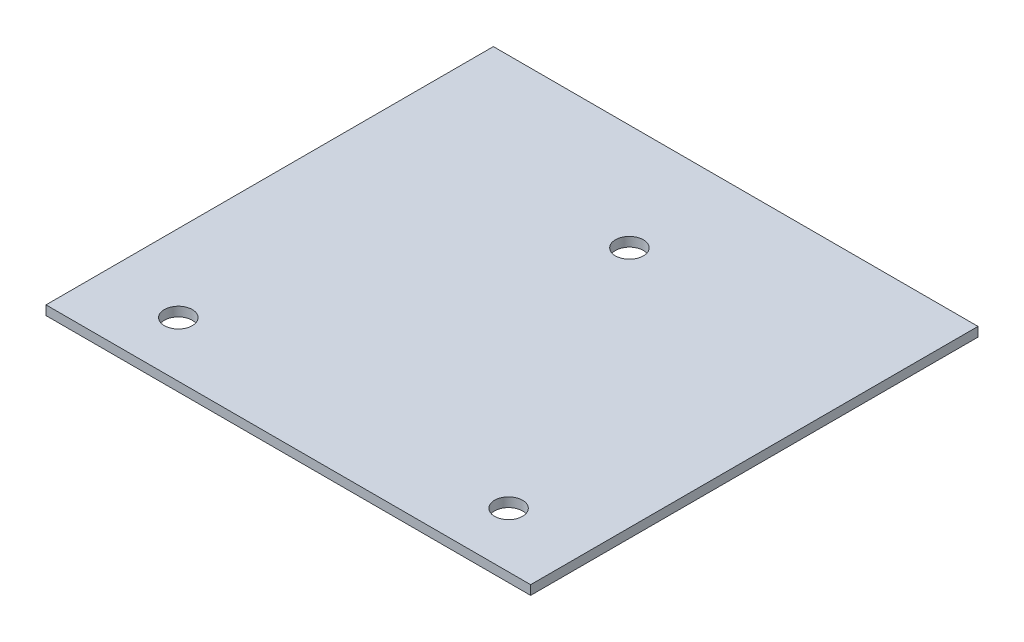
ISO-10303-21;
HEADER;
FILE_DESCRIPTION(('STEP AP214'),'2;1');
FILE_NAME('part.step','',(''),(''),'','','');
FILE_SCHEMA(('AUTOMOTIVE_DESIGN { 1 0 10303 214 1 1 1 1 }'));
ENDSEC;
DATA;
#1=APPLICATION_CONTEXT('core data for automotive mechanical design processes');
#2=APPLICATION_PROTOCOL_DEFINITION('international standard','automotive_design',2000,#1);
#3=PRODUCT_CONTEXT('',#1,'mechanical');
#4=PRODUCT('Part','Part','',(#3));
#5=PRODUCT_RELATED_PRODUCT_CATEGORY('part','',(#4));
#6=PRODUCT_DEFINITION_FORMATION('','',#4);
#7=PRODUCT_DEFINITION_CONTEXT('part definition',#1,'design');
#8=PRODUCT_DEFINITION('design','',#6,#7);
#9=PRODUCT_DEFINITION_SHAPE('','',#8);
#10=(LENGTH_UNIT() NAMED_UNIT(*) SI_UNIT(.MILLI.,.METRE.));
#11=(NAMED_UNIT(*) PLANE_ANGLE_UNIT() SI_UNIT($,.RADIAN.));
#12=(NAMED_UNIT(*) SI_UNIT($,.STERADIAN.) SOLID_ANGLE_UNIT());
#13=UNCERTAINTY_MEASURE_WITH_UNIT(LENGTH_MEASURE(1.E-05),#10,'distance_accuracy_value','');
#14=(GEOMETRIC_REPRESENTATION_CONTEXT(3) GLOBAL_UNCERTAINTY_ASSIGNED_CONTEXT((#13)) GLOBAL_UNIT_ASSIGNED_CONTEXT((#10,
#11,#12)) REPRESENTATION_CONTEXT('',''));
#15=CARTESIAN_POINT('',(0.,0.,0.));
#16=DIRECTION('',(0.,0.,1.));
#17=DIRECTION('',(1.,0.,0.));
#18=AXIS2_PLACEMENT_3D('',#15,#16,#17);
#19=CARTESIAN_POINT('',(0.,12.7,0.));
#20=DIRECTION('',(1.,0.,0.));
#21=DIRECTION('',(0.,0.,-1.));
#22=AXIS2_PLACEMENT_3D('',#19,#20,#21);
#23=PLANE('',#22);
#24=DIRECTION('',(0.,0.,1.));
#25=VECTOR('',#24,1.);
#26=CARTESIAN_POINT('',(0.,0.,0.));
#27=LINE('',#26,#25);
#28=CARTESIAN_POINT('',(0.,0.,-609.6));
#29=VERTEX_POINT('',#28);
#30=CARTESIAN_POINT('',(0.,0.,0.));
#31=VERTEX_POINT('',#30);
#32=EDGE_CURVE('E106',#29,#31,#27,.T.);
#33=ORIENTED_EDGE('',*,*,#32,.T.);
#34=DIRECTION('',(0.,-1.,0.));
#35=VECTOR('',#34,1.);
#36=CARTESIAN_POINT('',(0.,12.7,0.));
#37=LINE('',#36,#35);
#38=CARTESIAN_POINT('',(0.,12.7,0.));
#39=VERTEX_POINT('',#38);
#40=EDGE_CURVE('E11',#39,#31,#37,.T.);
#41=ORIENTED_EDGE('',*,*,#40,.F.);
#42=DIRECTION('',(0.,0.,1.));
#43=VECTOR('',#42,1.);
#44=CARTESIAN_POINT('',(0.,12.7,0.));
#45=LINE('',#44,#43);
#46=CARTESIAN_POINT('',(0.,12.7,-609.6));
#47=VERTEX_POINT('',#46);
#48=EDGE_CURVE('E90',#47,#39,#45,.T.);
#49=ORIENTED_EDGE('',*,*,#48,.F.);
#50=DIRECTION('',(0.,-1.,0.));
#51=VECTOR('',#50,1.);
#52=CARTESIAN_POINT('',(0.,12.7,-609.6));
#53=LINE('',#52,#51);
#54=EDGE_CURVE('E102',#47,#29,#53,.T.);
#55=ORIENTED_EDGE('',*,*,#54,.T.);
#56=EDGE_LOOP('',(#33,#41,#49,#55));
#57=FACE_BOUND('',#56,.T.);
#58=ADVANCED_FACE('F38',(#57),#23,.F.);
#59=CARTESIAN_POINT('',(0.,12.7,0.));
#60=DIRECTION('',(0.,0.,-1.));
#61=DIRECTION('',(-1.,0.,0.));
#62=AXIS2_PLACEMENT_3D('',#59,#60,#61);
#63=PLANE('',#62);
#64=DIRECTION('',(1.,0.,0.));
#65=VECTOR('',#64,1.);
#66=CARTESIAN_POINT('',(0.,0.,0.));
#67=LINE('',#66,#65);
#68=CARTESIAN_POINT('',(660.4,0.,0.));
#69=VERTEX_POINT('',#68);
#70=EDGE_CURVE('E95',#31,#69,#67,.T.);
#71=ORIENTED_EDGE('',*,*,#70,.T.);
#72=DIRECTION('',(0.,-1.,0.));
#73=VECTOR('',#72,1.);
#74=CARTESIAN_POINT('',(660.4,12.7,0.));
#75=LINE('',#74,#73);
#76=CARTESIAN_POINT('',(660.4,12.7,0.));
#77=VERTEX_POINT('',#76);
#78=EDGE_CURVE('E47',#77,#69,#75,.T.);
#79=ORIENTED_EDGE('',*,*,#78,.F.);
#80=DIRECTION('',(1.,0.,0.));
#81=VECTOR('',#80,1.);
#82=CARTESIAN_POINT('',(0.,12.7,0.));
#83=LINE('',#82,#81);
#84=EDGE_CURVE('E85',#39,#77,#83,.T.);
#85=ORIENTED_EDGE('',*,*,#84,.F.);
#86=ORIENTED_EDGE('',*,*,#40,.T.);
#87=EDGE_LOOP('',(#71,#79,#85,#86));
#88=FACE_BOUND('',#87,.T.);
#89=ADVANCED_FACE('F94',(#88),#63,.F.);
#90=CARTESIAN_POINT('',(660.4,12.7,0.));
#91=DIRECTION('',(-1.,0.,0.));
#92=DIRECTION('',(0.,0.,1.));
#93=AXIS2_PLACEMENT_3D('',#90,#91,#92);
#94=PLANE('',#93);
#95=DIRECTION('',(0.,0.,-1.));
#96=VECTOR('',#95,1.);
#97=CARTESIAN_POINT('',(660.4,0.,0.));
#98=LINE('',#97,#96);
#99=CARTESIAN_POINT('',(660.4,0.,-609.6));
#100=VERTEX_POINT('',#99);
#101=EDGE_CURVE('E72',#69,#100,#98,.T.);
#102=ORIENTED_EDGE('',*,*,#101,.T.);
#103=DIRECTION('',(0.,-1.,0.));
#104=VECTOR('',#103,1.);
#105=CARTESIAN_POINT('',(660.4,12.7,-609.6));
#106=LINE('',#105,#104);
#107=CARTESIAN_POINT('',(660.4,12.7,-609.6));
#108=VERTEX_POINT('',#107);
#109=EDGE_CURVE('E97',#108,#100,#106,.T.);
#110=ORIENTED_EDGE('',*,*,#109,.F.);
#111=DIRECTION('',(0.,0.,-1.));
#112=VECTOR('',#111,1.);
#113=CARTESIAN_POINT('',(660.4,12.7,0.));
#114=LINE('',#113,#112);
#115=EDGE_CURVE('E88',#77,#108,#114,.T.);
#116=ORIENTED_EDGE('',*,*,#115,.F.);
#117=ORIENTED_EDGE('',*,*,#78,.T.);
#118=EDGE_LOOP('',(#102,#110,#116,#117));
#119=FACE_BOUND('',#118,.T.);
#120=ADVANCED_FACE('F98',(#119),#94,.F.);
#121=CARTESIAN_POINT('',(0.,12.7,-609.6));
#122=DIRECTION('',(0.,0.,1.));
#123=DIRECTION('',(1.,0.,0.));
#124=AXIS2_PLACEMENT_3D('',#121,#122,#123);
#125=PLANE('',#124);
#126=DIRECTION('',(-1.,0.,0.));
#127=VECTOR('',#126,1.);
#128=CARTESIAN_POINT('',(0.,0.,-609.6));
#129=LINE('',#128,#127);
#130=EDGE_CURVE('E78',#100,#29,#129,.T.);
#131=ORIENTED_EDGE('',*,*,#130,.T.);
#132=ORIENTED_EDGE('',*,*,#54,.F.);
#133=DIRECTION('',(-1.,0.,0.));
#134=VECTOR('',#133,1.);
#135=CARTESIAN_POINT('',(0.,12.7,-609.6));
#136=LINE('',#135,#134);
#137=EDGE_CURVE('E55',#108,#47,#136,.T.);
#138=ORIENTED_EDGE('',*,*,#137,.F.);
#139=ORIENTED_EDGE('',*,*,#109,.T.);
#140=EDGE_LOOP('',(#131,#132,#138,#139));
#141=FACE_BOUND('',#140,.T.);
#142=ADVANCED_FACE('F120',(#141),#125,.F.);
#143=CARTESIAN_POINT('',(0.,12.7,0.));
#144=DIRECTION('',(0.,-1.,0.));
#145=DIRECTION('',(0.,0.,-1.));
#146=AXIS2_PLACEMENT_3D('',#143,#144,#145);
#147=PLANE('',#146);
#148=CARTESIAN_POINT('',(105.2,12.7,-75.1166466365201));
#149=DIRECTION('',(0.,1.,0.));
#150=DIRECTION('',(0.,0.,1.));
#151=AXIS2_PLACEMENT_3D('',#148,#149,#150);
#152=CIRCLE('',#151,19.05);
#153=CARTESIAN_POINT('',(105.2,12.7,-56.0666466365201));
#154=VERTEX_POINT('',#153);
#155=EDGE_CURVE('E143',#154,#154,#152,.T.);
#156=ORIENTED_EDGE('',*,*,#155,.F.);
#157=EDGE_LOOP('',(#156));
#158=FACE_BOUND('',#157,.T.);
#159=CARTESIAN_POINT('',(555.2,12.7,-75.1166466365201));
#160=DIRECTION('',(0.,1.,0.));
#161=DIRECTION('',(0.,0.,1.));
#162=AXIS2_PLACEMENT_3D('',#159,#160,#161);
#163=CIRCLE('',#162,19.05);
#164=CARTESIAN_POINT('',(555.2,12.7,-56.0666466365201));
#165=VERTEX_POINT('',#164);
#166=EDGE_CURVE('E135',#165,#165,#163,.T.);
#167=ORIENTED_EDGE('',*,*,#166,.F.);
#168=EDGE_LOOP('',(#167));
#169=FACE_BOUND('',#168,.T.);
#170=CARTESIAN_POINT('',(330.2,12.7,-464.828078339517));
#171=DIRECTION('',(0.,1.,0.));
#172=DIRECTION('',(0.,0.,1.));
#173=AXIS2_PLACEMENT_3D('',#170,#171,#172);
#174=CIRCLE('',#173,19.05);
#175=CARTESIAN_POINT('',(330.2,12.7,-445.778078339517));
#176=VERTEX_POINT('',#175);
#177=EDGE_CURVE('E127',#176,#176,#174,.T.);
#178=ORIENTED_EDGE('',*,*,#177,.F.);
#179=EDGE_LOOP('',(#178));
#180=FACE_BOUND('',#179,.T.);
#181=ORIENTED_EDGE('',*,*,#48,.T.);
#182=ORIENTED_EDGE('',*,*,#84,.T.);
#183=ORIENTED_EDGE('',*,*,#115,.T.);
#184=ORIENTED_EDGE('',*,*,#137,.T.);
#185=EDGE_LOOP('',(#181,#182,#183,#184));
#186=FACE_BOUND('',#185,.T.);
#187=ADVANCED_FACE('F86',(#158,#169,#180,#186),#147,.F.);
#188=CARTESIAN_POINT('',(0.,0.,0.));
#189=DIRECTION('',(0.,-1.,0.));
#190=DIRECTION('',(0.,0.,-1.));
#191=AXIS2_PLACEMENT_3D('',#188,#189,#190);
#192=PLANE('',#191);
#193=CARTESIAN_POINT('',(105.2,0.,-75.1166466365201));
#194=DIRECTION('',(0.,1.,0.));
#195=DIRECTION('',(0.,0.,1.));
#196=AXIS2_PLACEMENT_3D('',#193,#194,#195);
#197=CIRCLE('',#196,19.05);
#198=CARTESIAN_POINT('',(105.2,0.,-56.0666466365201));
#199=VERTEX_POINT('',#198);
#200=EDGE_CURVE('E110',#199,#199,#197,.T.);
#201=ORIENTED_EDGE('',*,*,#200,.T.);
#202=EDGE_LOOP('',(#201));
#203=FACE_BOUND('',#202,.T.);
#204=CARTESIAN_POINT('',(555.2,0.,-75.1166466365201));
#205=DIRECTION('',(0.,1.,0.));
#206=DIRECTION('',(0.,0.,1.));
#207=AXIS2_PLACEMENT_3D('',#204,#205,#206);
#208=CIRCLE('',#207,19.05);
#209=CARTESIAN_POINT('',(555.2,0.,-56.0666466365201));
#210=VERTEX_POINT('',#209);
#211=EDGE_CURVE('E139',#210,#210,#208,.T.);
#212=ORIENTED_EDGE('',*,*,#211,.T.);
#213=EDGE_LOOP('',(#212));
#214=FACE_BOUND('',#213,.T.);
#215=CARTESIAN_POINT('',(330.2,0.,-464.828078339517));
#216=DIRECTION('',(0.,1.,0.));
#217=DIRECTION('',(0.,0.,1.));
#218=AXIS2_PLACEMENT_3D('',#215,#216,#217);
#219=CIRCLE('',#218,19.05);
#220=CARTESIAN_POINT('',(330.2,0.,-445.778078339517));
#221=VERTEX_POINT('',#220);
#222=EDGE_CURVE('E131',#221,#221,#219,.T.);
#223=ORIENTED_EDGE('',*,*,#222,.T.);
#224=EDGE_LOOP('',(#223));
#225=FACE_BOUND('',#224,.T.);
#226=ORIENTED_EDGE('',*,*,#32,.F.);
#227=ORIENTED_EDGE('',*,*,#130,.F.);
#228=ORIENTED_EDGE('',*,*,#101,.F.);
#229=ORIENTED_EDGE('',*,*,#70,.F.);
#230=EDGE_LOOP('',(#226,#227,#228,#229));
#231=FACE_BOUND('',#230,.T.);
#232=ADVANCED_FACE('F123',(#203,#214,#225,#231),#192,.T.);
#233=CARTESIAN_POINT('',(330.2,0.,-464.828078339517));
#234=DIRECTION('',(0.,1.,0.));
#235=DIRECTION('',(0.,0.,1.));
#236=AXIS2_PLACEMENT_3D('',#233,#234,#235);
#237=CYLINDRICAL_SURFACE('',#236,19.05);
#238=ORIENTED_EDGE('',*,*,#222,.F.);
#239=EDGE_LOOP('',(#238));
#240=FACE_BOUND('',#239,.T.);
#241=ORIENTED_EDGE('',*,*,#177,.T.);
#242=EDGE_LOOP('',(#241));
#243=FACE_BOUND('',#242,.T.);
#244=ADVANCED_FACE('F167',(#240,#243),#237,.F.);
#245=CARTESIAN_POINT('',(555.2,0.,-75.1166466365201));
#246=DIRECTION('',(0.,1.,0.));
#247=DIRECTION('',(0.,0.,1.));
#248=AXIS2_PLACEMENT_3D('',#245,#246,#247);
#249=CYLINDRICAL_SURFACE('',#248,19.05);
#250=ORIENTED_EDGE('',*,*,#211,.F.);
#251=EDGE_LOOP('',(#250));
#252=FACE_BOUND('',#251,.T.);
#253=ORIENTED_EDGE('',*,*,#166,.T.);
#254=EDGE_LOOP('',(#253));
#255=FACE_BOUND('',#254,.T.);
#256=ADVANCED_FACE('F156',(#252,#255),#249,.F.);
#257=CARTESIAN_POINT('',(105.2,0.,-75.1166466365201));
#258=DIRECTION('',(0.,1.,0.));
#259=DIRECTION('',(0.,0.,1.));
#260=AXIS2_PLACEMENT_3D('',#257,#258,#259);
#261=CYLINDRICAL_SURFACE('',#260,19.05);
#262=ORIENTED_EDGE('',*,*,#200,.F.);
#263=EDGE_LOOP('',(#262));
#264=FACE_BOUND('',#263,.T.);
#265=ORIENTED_EDGE('',*,*,#155,.T.);
#266=EDGE_LOOP('',(#265));
#267=FACE_BOUND('',#266,.T.);
#268=ADVANCED_FACE('F153',(#264,#267),#261,.F.);
#269=CLOSED_SHELL('',(#58,#89,#120,#142,#187,#232,#244,#256,#268));
#270=MANIFOLD_SOLID_BREP('B2',#269);
#271=ADVANCED_BREP_SHAPE_REPRESENTATION('',(#18,#270),#14);
#272=SHAPE_DEFINITION_REPRESENTATION(#9,#271);
ENDSEC;
END-ISO-10303-21;
